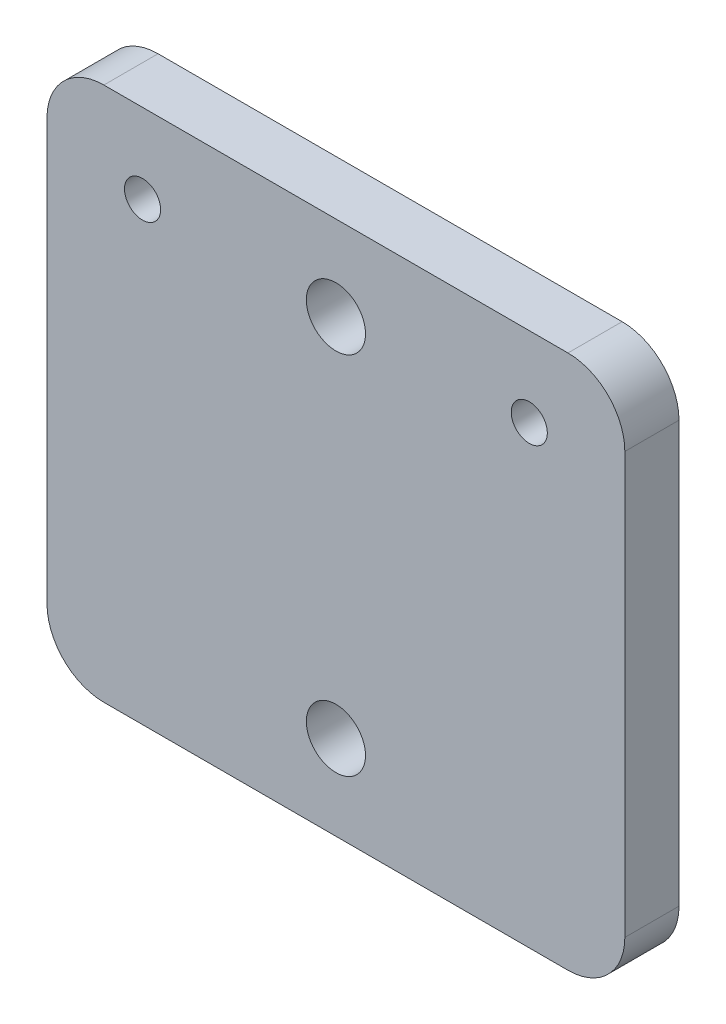
ISO-10303-21;
HEADER;
FILE_DESCRIPTION(('STEP AP214'),'2;1');
FILE_NAME('part.step','',(''),(''),'','','');
FILE_SCHEMA(('AUTOMOTIVE_DESIGN { 1 0 10303 214 1 1 1 1 }'));
ENDSEC;
DATA;
#1=APPLICATION_CONTEXT('core data for automotive mechanical design processes');
#2=APPLICATION_PROTOCOL_DEFINITION('international standard','automotive_design',2000,#1);
#3=PRODUCT_CONTEXT('',#1,'mechanical');
#4=PRODUCT('Part','Part','',(#3));
#5=PRODUCT_RELATED_PRODUCT_CATEGORY('part','',(#4));
#6=PRODUCT_DEFINITION_FORMATION('','',#4);
#7=PRODUCT_DEFINITION_CONTEXT('part definition',#1,'design');
#8=PRODUCT_DEFINITION('design','',#6,#7);
#9=PRODUCT_DEFINITION_SHAPE('','',#8);
#10=(LENGTH_UNIT() NAMED_UNIT(*) SI_UNIT(.MILLI.,.METRE.));
#11=(NAMED_UNIT(*) PLANE_ANGLE_UNIT() SI_UNIT($,.RADIAN.));
#12=(NAMED_UNIT(*) SI_UNIT($,.STERADIAN.) SOLID_ANGLE_UNIT());
#13=UNCERTAINTY_MEASURE_WITH_UNIT(LENGTH_MEASURE(1.E-05),#10,'distance_accuracy_value','');
#14=(GEOMETRIC_REPRESENTATION_CONTEXT(3) GLOBAL_UNCERTAINTY_ASSIGNED_CONTEXT((#13)) GLOBAL_UNIT_ASSIGNED_CONTEXT((#10,
#11,#12)) REPRESENTATION_CONTEXT('',''));
#15=CARTESIAN_POINT('',(0.,0.,0.));
#16=DIRECTION('',(0.,0.,1.));
#17=DIRECTION('',(1.,0.,0.));
#18=AXIS2_PLACEMENT_3D('',#15,#16,#17);
#19=CARTESIAN_POINT('',(0.,0.,4.7625));
#20=DIRECTION('',(1.,0.,0.));
#21=DIRECTION('',(0.,0.,-1.));
#22=AXIS2_PLACEMENT_3D('',#19,#20,#21);
#23=PLANE('',#22);
#24=DIRECTION('',(0.,-1.,0.));
#25=VECTOR('',#24,1.);
#26=CARTESIAN_POINT('',(0.,0.,0.));
#27=LINE('',#26,#25);
#28=CARTESIAN_POINT('',(0.,41.9999999999998,0.));
#29=VERTEX_POINT('',#28);
#30=CARTESIAN_POINT('',(0.,4.99999999999953,0.));
#31=VERTEX_POINT('',#30);
#32=EDGE_CURVE('E129',#29,#31,#27,.T.);
#33=ORIENTED_EDGE('',*,*,#32,.T.);
#34=DIRECTION('',(0.,0.,-1.));
#35=VECTOR('',#34,1.);
#36=CARTESIAN_POINT('',(0.,4.99999999999953,4.7625));
#37=LINE('',#36,#35);
#38=CARTESIAN_POINT('',(0.,4.99999999999953,4.7625));
#39=VERTEX_POINT('',#38);
#40=EDGE_CURVE('E107',#31,#39,#37,.F.);
#41=ORIENTED_EDGE('',*,*,#40,.T.);
#42=DIRECTION('',(0.,-1.,0.));
#43=VECTOR('',#42,1.);
#44=CARTESIAN_POINT('',(0.,0.,4.7625));
#45=LINE('',#44,#43);
#46=CARTESIAN_POINT('',(0.,41.9999999999998,4.7625));
#47=VERTEX_POINT('',#46);
#48=EDGE_CURVE('E139',#47,#39,#45,.T.);
#49=ORIENTED_EDGE('',*,*,#48,.F.);
#50=DIRECTION('',(0.,0.,-1.));
#51=VECTOR('',#50,1.);
#52=CARTESIAN_POINT('',(0.,41.9999999999998,4.7625));
#53=LINE('',#52,#51);
#54=EDGE_CURVE('E112',#47,#29,#53,.T.);
#55=ORIENTED_EDGE('',*,*,#54,.T.);
#56=EDGE_LOOP('',(#33,#41,#49,#55));
#57=FACE_BOUND('',#56,.T.);
#58=ADVANCED_FACE('F34',(#57),#23,.F.);
#59=CARTESIAN_POINT('',(0.,0.,4.7625));
#60=DIRECTION('',(0.,1.,0.));
#61=DIRECTION('',(0.,0.,1.));
#62=AXIS2_PLACEMENT_3D('',#59,#60,#61);
#63=PLANE('',#62);
#64=DIRECTION('',(1.,0.,0.));
#65=VECTOR('',#64,1.);
#66=CARTESIAN_POINT('',(0.,0.,4.7625));
#67=LINE('',#66,#65);
#68=CARTESIAN_POINT('',(5.00000000000007,-1.66533453693773E-13,4.7625));
#69=VERTEX_POINT('',#68);
#70=CARTESIAN_POINT('',(45.8,0.,4.7625));
#71=VERTEX_POINT('',#70);
#72=EDGE_CURVE('E122',#69,#71,#67,.T.);
#73=ORIENTED_EDGE('',*,*,#72,.F.);
#74=DIRECTION('',(0.,0.,-1.));
#75=VECTOR('',#74,1.);
#76=CARTESIAN_POINT('',(5.00000000000007,-1.66533453693773E-13,4.7625));
#77=LINE('',#76,#75);
#78=CARTESIAN_POINT('',(5.,-1.66533453693773E-13,0.));
#79=VERTEX_POINT('',#78);
#80=EDGE_CURVE('E106',#69,#79,#77,.T.);
#81=ORIENTED_EDGE('',*,*,#80,.T.);
#82=DIRECTION('',(1.,0.,0.));
#83=VECTOR('',#82,1.);
#84=CARTESIAN_POINT('',(0.,0.,0.));
#85=LINE('',#84,#83);
#86=CARTESIAN_POINT('',(45.8000000000002,0.,0.));
#87=VERTEX_POINT('',#86);
#88=EDGE_CURVE('E119',#79,#87,#85,.T.);
#89=ORIENTED_EDGE('',*,*,#88,.T.);
#90=DIRECTION('',(0.,0.,-1.));
#91=VECTOR('',#90,1.);
#92=CARTESIAN_POINT('',(45.8,0.,4.7625));
#93=LINE('',#92,#91);
#94=EDGE_CURVE('E124',#87,#71,#93,.F.);
#95=ORIENTED_EDGE('',*,*,#94,.T.);
#96=EDGE_LOOP('',(#73,#81,#89,#95));
#97=FACE_BOUND('',#96,.T.);
#98=ADVANCED_FACE('F118',(#97),#63,.F.);
#99=CARTESIAN_POINT('',(50.8000000000002,1.38777878078145E-13,4.7625));
#100=DIRECTION('',(-1.,0.,0.));
#101=DIRECTION('',(0.,0.,1.));
#102=AXIS2_PLACEMENT_3D('',#99,#100,#101);
#103=PLANE('',#102);
#104=DIRECTION('',(0.,1.,0.));
#105=VECTOR('',#104,1.);
#106=CARTESIAN_POINT('',(50.8000000000002,1.38777878078145E-13,4.7625));
#107=LINE('',#106,#105);
#108=CARTESIAN_POINT('',(50.8,4.99999999999984,4.7625));
#109=VERTEX_POINT('',#108);
#110=CARTESIAN_POINT('',(50.8,42.,4.7625));
#111=VERTEX_POINT('',#110);
#112=EDGE_CURVE('E189',#109,#111,#107,.T.);
#113=ORIENTED_EDGE('',*,*,#112,.F.);
#114=DIRECTION('',(0.,0.,-1.));
#115=VECTOR('',#114,1.);
#116=CARTESIAN_POINT('',(50.8,4.99999999999984,4.7625));
#117=LINE('',#116,#115);
#118=CARTESIAN_POINT('',(50.8000000000001,4.99999999999978,0.));
#119=VERTEX_POINT('',#118);
#120=EDGE_CURVE('E158',#109,#119,#117,.T.);
#121=ORIENTED_EDGE('',*,*,#120,.T.);
#122=DIRECTION('',(0.,1.,0.));
#123=VECTOR('',#122,1.);
#124=CARTESIAN_POINT('',(50.8,1.38777878078145E-13,0.));
#125=LINE('',#124,#123);
#126=CARTESIAN_POINT('',(50.8000000000001,42.0000000000001,0.));
#127=VERTEX_POINT('',#126);
#128=EDGE_CURVE('E128',#119,#127,#125,.T.);
#129=ORIENTED_EDGE('',*,*,#128,.T.);
#130=DIRECTION('',(0.,0.,-1.));
#131=VECTOR('',#130,1.);
#132=CARTESIAN_POINT('',(50.8,42.,4.7625));
#133=LINE('',#132,#131);
#134=EDGE_CURVE('E156',#127,#111,#133,.F.);
#135=ORIENTED_EDGE('',*,*,#134,.T.);
#136=EDGE_LOOP('',(#113,#121,#129,#135));
#137=FACE_BOUND('',#136,.T.);
#138=ADVANCED_FACE('F204',(#137),#103,.F.);
#139=CARTESIAN_POINT('',(0.,46.9999999999999,4.76250000000006));
#140=DIRECTION('',(0.,-1.,0.));
#141=DIRECTION('',(0.,0.,-1.));
#142=AXIS2_PLACEMENT_3D('',#139,#140,#141);
#143=PLANE('',#142);
#144=DIRECTION('',(-1.,0.,0.));
#145=VECTOR('',#144,1.);
#146=CARTESIAN_POINT('',(0.,46.9999999999999,4.76250000000006));
#147=LINE('',#146,#145);
#148=CARTESIAN_POINT('',(45.8000000000001,46.9999999999999,4.76250000000031));
#149=VERTEX_POINT('',#148);
#150=CARTESIAN_POINT('',(5.00000000000007,47.,4.76250000000031));
#151=VERTEX_POINT('',#150);
#152=EDGE_CURVE('E140',#149,#151,#147,.T.);
#153=ORIENTED_EDGE('',*,*,#152,.F.);
#154=DIRECTION('',(0.,0.,-1.));
#155=VECTOR('',#154,1.);
#156=CARTESIAN_POINT('',(45.8000000000001,46.9999999999999,4.76250000000031));
#157=LINE('',#156,#155);
#158=CARTESIAN_POINT('',(45.8,47.,3.05311331771918E-13));
#159=VERTEX_POINT('',#158);
#160=EDGE_CURVE('E11',#149,#159,#157,.T.);
#161=ORIENTED_EDGE('',*,*,#160,.T.);
#162=DIRECTION('',(-1.,0.,0.));
#163=VECTOR('',#162,1.);
#164=CARTESIAN_POINT('',(0.,47.,3.05311331771918E-13));
#165=LINE('',#164,#163);
#166=CARTESIAN_POINT('',(5.00000000000007,47.,3.05311331771918E-13));
#167=VERTEX_POINT('',#166);
#168=EDGE_CURVE('E132',#159,#167,#165,.T.);
#169=ORIENTED_EDGE('',*,*,#168,.T.);
#170=DIRECTION('',(0.,0.,-1.));
#171=VECTOR('',#170,1.);
#172=CARTESIAN_POINT('',(5.00000000000007,47.,4.76250000000031));
#173=LINE('',#172,#171);
#174=EDGE_CURVE('E43',#167,#151,#173,.F.);
#175=ORIENTED_EDGE('',*,*,#174,.T.);
#176=EDGE_LOOP('',(#153,#161,#169,#175));
#177=FACE_BOUND('',#176,.T.);
#178=ADVANCED_FACE('F198',(#177),#143,.F.);
#179=CARTESIAN_POINT('',(0.,0.,4.7625));
#180=DIRECTION('',(0.,0.,-1.));
#181=DIRECTION('',(-1.,0.,0.));
#182=AXIS2_PLACEMENT_3D('',#179,#180,#181);
#183=PLANE('',#182);
#184=CARTESIAN_POINT('',(8.4,39.9999999999998,4.7625));
#185=DIRECTION('',(0.,0.,1.));
#186=DIRECTION('',(1.,0.,0.));
#187=AXIS2_PLACEMENT_3D('',#184,#185,#186);
#188=CIRCLE('',#187,1.5875);
#189=CARTESIAN_POINT('',(9.9875,39.9999999999998,4.7625));
#190=VERTEX_POINT('',#189);
#191=EDGE_CURVE('E163',#190,#190,#188,.T.);
#192=ORIENTED_EDGE('',*,*,#191,.F.);
#193=EDGE_LOOP('',(#192));
#194=FACE_BOUND('',#193,.T.);
#195=CARTESIAN_POINT('',(42.4000000000002,39.9999999999998,4.7625));
#196=DIRECTION('',(0.,0.,1.));
#197=DIRECTION('',(1.,0.,0.));
#198=AXIS2_PLACEMENT_3D('',#195,#196,#197);
#199=CIRCLE('',#198,1.5875);
#200=CARTESIAN_POINT('',(43.9875000000002,39.9999999999998,4.7625));
#201=VERTEX_POINT('',#200);
#202=EDGE_CURVE('E169',#201,#201,#199,.T.);
#203=ORIENTED_EDGE('',*,*,#202,.F.);
#204=EDGE_LOOP('',(#203));
#205=FACE_BOUND('',#204,.T.);
#206=CARTESIAN_POINT('',(25.4000000000002,39.55,4.7625));
#207=DIRECTION('',(0.,0.,1.));
#208=DIRECTION('',(1.,0.,0.));
#209=AXIS2_PLACEMENT_3D('',#206,#207,#208);
#210=CIRCLE('',#209,2.6);
#211=CARTESIAN_POINT('',(28.0000000000001,39.55,4.7625));
#212=VERTEX_POINT('',#211);
#213=EDGE_CURVE('E178',#212,#212,#210,.T.);
#214=ORIENTED_EDGE('',*,*,#213,.F.);
#215=EDGE_LOOP('',(#214));
#216=FACE_BOUND('',#215,.T.);
#217=CARTESIAN_POINT('',(25.4000000000001,7.44999999999971,4.7625));
#218=DIRECTION('',(0.,0.,1.));
#219=DIRECTION('',(1.,0.,0.));
#220=AXIS2_PLACEMENT_3D('',#217,#218,#219);
#221=CIRCLE('',#220,2.6);
#222=CARTESIAN_POINT('',(28.0000000000001,7.44999999999971,4.7625));
#223=VERTEX_POINT('',#222);
#224=EDGE_CURVE('E167',#223,#223,#221,.T.);
#225=ORIENTED_EDGE('',*,*,#224,.F.);
#226=EDGE_LOOP('',(#225));
#227=FACE_BOUND('',#226,.T.);
#228=ORIENTED_EDGE('',*,*,#48,.T.);
#229=CARTESIAN_POINT('',(5.,4.99999999999984,4.76250000000028));
#230=DIRECTION('',(0.,0.,-1.));
#231=DIRECTION('',(-1.,0.,0.));
#232=AXIS2_PLACEMENT_3D('',#229,#230,#231);
#233=CIRCLE('',#232,5.);
#234=EDGE_CURVE('E154',#39,#69,#233,.F.);
#235=ORIENTED_EDGE('',*,*,#234,.T.);
#236=ORIENTED_EDGE('',*,*,#72,.T.);
#237=CARTESIAN_POINT('',(45.8000000000002,4.99999999999953,4.7625));
#238=DIRECTION('',(0.,0.,-1.));
#239=DIRECTION('',(-1.,0.,0.));
#240=AXIS2_PLACEMENT_3D('',#237,#238,#239);
#241=CIRCLE('',#240,5.);
#242=EDGE_CURVE('E152',#71,#109,#241,.F.);
#243=ORIENTED_EDGE('',*,*,#242,.T.);
#244=ORIENTED_EDGE('',*,*,#112,.T.);
#245=CARTESIAN_POINT('',(45.8000000000002,41.9999999999998,4.76250000000031));
#246=DIRECTION('',(0.,0.,-1.));
#247=DIRECTION('',(-1.,0.,0.));
#248=AXIS2_PLACEMENT_3D('',#245,#246,#247);
#249=CIRCLE('',#248,5.);
#250=EDGE_CURVE('E57',#111,#149,#249,.F.);
#251=ORIENTED_EDGE('',*,*,#250,.T.);
#252=ORIENTED_EDGE('',*,*,#152,.T.);
#253=CARTESIAN_POINT('',(4.99999999999996,42.,4.76250000000031));
#254=DIRECTION('',(0.,0.,-1.));
#255=DIRECTION('',(-1.,0.,0.));
#256=AXIS2_PLACEMENT_3D('',#253,#254,#255);
#257=CIRCLE('',#256,5.);
#258=EDGE_CURVE('E149',#151,#47,#257,.F.);
#259=ORIENTED_EDGE('',*,*,#258,.T.);
#260=EDGE_LOOP('',(#228,#235,#236,#243,#244,#251,#252,#259));
#261=FACE_BOUND('',#260,.T.);
#262=ADVANCED_FACE('F191',(#194,#205,#216,#227,#261),#183,.F.);
#263=CARTESIAN_POINT('',(0.,0.,0.));
#264=DIRECTION('',(0.,0.,-1.));
#265=DIRECTION('',(-1.,0.,0.));
#266=AXIS2_PLACEMENT_3D('',#263,#264,#265);
#267=PLANE('',#266);
#268=CARTESIAN_POINT('',(8.4,39.9999999999998,0.));
#269=DIRECTION('',(0.,0.,-1.));
#270=DIRECTION('',(-1.,0.,0.));
#271=AXIS2_PLACEMENT_3D('',#268,#269,#270);
#272=CIRCLE('',#271,1.5875);
#273=CARTESIAN_POINT('',(6.8125,39.9999999999998,0.));
#274=VERTEX_POINT('',#273);
#275=EDGE_CURVE('E38',#274,#274,#272,.T.);
#276=ORIENTED_EDGE('',*,*,#275,.F.);
#277=EDGE_LOOP('',(#276));
#278=FACE_BOUND('',#277,.T.);
#279=CARTESIAN_POINT('',(42.4000000000001,39.9999999999998,0.));
#280=DIRECTION('',(0.,0.,-1.));
#281=DIRECTION('',(-1.,0.,0.));
#282=AXIS2_PLACEMENT_3D('',#279,#280,#281);
#283=CIRCLE('',#282,1.5875);
#284=CARTESIAN_POINT('',(40.8125000000001,39.9999999999998,0.));
#285=VERTEX_POINT('',#284);
#286=EDGE_CURVE('E161',#285,#285,#283,.T.);
#287=ORIENTED_EDGE('',*,*,#286,.F.);
#288=EDGE_LOOP('',(#287));
#289=FACE_BOUND('',#288,.T.);
#290=CARTESIAN_POINT('',(25.4,39.55,0.));
#291=DIRECTION('',(0.,0.,1.));
#292=DIRECTION('',(1.,0.,0.));
#293=AXIS2_PLACEMENT_3D('',#290,#291,#292);
#294=CIRCLE('',#293,2.6);
#295=CARTESIAN_POINT('',(28.,39.55,0.));
#296=VERTEX_POINT('',#295);
#297=EDGE_CURVE('E134',#296,#296,#294,.T.);
#298=ORIENTED_EDGE('',*,*,#297,.T.);
#299=EDGE_LOOP('',(#298));
#300=FACE_BOUND('',#299,.T.);
#301=CARTESIAN_POINT('',(25.4,7.44999999999971,0.));
#302=DIRECTION('',(0.,0.,1.));
#303=DIRECTION('',(1.,0.,0.));
#304=AXIS2_PLACEMENT_3D('',#301,#302,#303);
#305=CIRCLE('',#304,2.6);
#306=CARTESIAN_POINT('',(28.,7.44999999999971,0.));
#307=VERTEX_POINT('',#306);
#308=EDGE_CURVE('E181',#307,#307,#305,.T.);
#309=ORIENTED_EDGE('',*,*,#308,.T.);
#310=EDGE_LOOP('',(#309));
#311=FACE_BOUND('',#310,.T.);
#312=ORIENTED_EDGE('',*,*,#88,.F.);
#313=CARTESIAN_POINT('',(5.00000000000007,4.99999999999984,3.05311331771918E-13));
#314=DIRECTION('',(0.,0.,-1.));
#315=DIRECTION('',(-1.,0.,0.));
#316=AXIS2_PLACEMENT_3D('',#313,#314,#315);
#317=CIRCLE('',#316,5.);
#318=EDGE_CURVE('E102',#79,#31,#317,.T.);
#319=ORIENTED_EDGE('',*,*,#318,.T.);
#320=ORIENTED_EDGE('',*,*,#32,.F.);
#321=CARTESIAN_POINT('',(5.,42.0000000000001,3.05311331771918E-13));
#322=DIRECTION('',(0.,0.,-1.));
#323=DIRECTION('',(-1.,0.,0.));
#324=AXIS2_PLACEMENT_3D('',#321,#322,#323);
#325=CIRCLE('',#324,5.);
#326=EDGE_CURVE('E123',#29,#167,#325,.T.);
#327=ORIENTED_EDGE('',*,*,#326,.T.);
#328=ORIENTED_EDGE('',*,*,#168,.F.);
#329=CARTESIAN_POINT('',(45.8,41.9999999999998,3.05311331771918E-13));
#330=DIRECTION('',(0.,0.,-1.));
#331=DIRECTION('',(-1.,0.,0.));
#332=AXIS2_PLACEMENT_3D('',#329,#330,#331);
#333=CIRCLE('',#332,5.);
#334=EDGE_CURVE('E143',#159,#127,#333,.T.);
#335=ORIENTED_EDGE('',*,*,#334,.T.);
#336=ORIENTED_EDGE('',*,*,#128,.F.);
#337=CARTESIAN_POINT('',(45.8000000000001,4.99999999999953,0.));
#338=DIRECTION('',(0.,0.,-1.));
#339=DIRECTION('',(-1.,0.,0.));
#340=AXIS2_PLACEMENT_3D('',#337,#338,#339);
#341=CIRCLE('',#340,5.);
#342=EDGE_CURVE('E113',#119,#87,#341,.T.);
#343=ORIENTED_EDGE('',*,*,#342,.T.);
#344=EDGE_LOOP('',(#312,#319,#320,#327,#328,#335,#336,#343));
#345=FACE_BOUND('',#344,.T.);
#346=ADVANCED_FACE('F126',(#278,#289,#300,#311,#345),#267,.T.);
#347=CARTESIAN_POINT('',(25.4,7.44999999999971,0.));
#348=DIRECTION('',(0.,0.,1.));
#349=DIRECTION('',(1.,0.,0.));
#350=AXIS2_PLACEMENT_3D('',#347,#348,#349);
#351=CYLINDRICAL_SURFACE('',#350,2.6);
#352=ORIENTED_EDGE('',*,*,#308,.F.);
#353=EDGE_LOOP('',(#352));
#354=FACE_BOUND('',#353,.T.);
#355=ORIENTED_EDGE('',*,*,#224,.T.);
#356=EDGE_LOOP('',(#355));
#357=FACE_BOUND('',#356,.T.);
#358=ADVANCED_FACE('F230',(#354,#357),#351,.F.);
#359=CARTESIAN_POINT('',(25.4,39.55,0.));
#360=DIRECTION('',(0.,0.,1.));
#361=DIRECTION('',(1.,0.,0.));
#362=AXIS2_PLACEMENT_3D('',#359,#360,#361);
#363=CYLINDRICAL_SURFACE('',#362,2.6);
#364=ORIENTED_EDGE('',*,*,#297,.F.);
#365=EDGE_LOOP('',(#364));
#366=FACE_BOUND('',#365,.T.);
#367=ORIENTED_EDGE('',*,*,#213,.T.);
#368=EDGE_LOOP('',(#367));
#369=FACE_BOUND('',#368,.T.);
#370=ADVANCED_FACE('F215',(#366,#369),#363,.F.);
#371=CARTESIAN_POINT('',(5.,4.99999999999984,4.76250000000028));
#372=DIRECTION('',(0.,0.,-1.));
#373=DIRECTION('',(-1.,0.,0.));
#374=AXIS2_PLACEMENT_3D('',#371,#372,#373);
#375=CYLINDRICAL_SURFACE('',#374,5.);
#376=ORIENTED_EDGE('',*,*,#234,.F.);
#377=ORIENTED_EDGE('',*,*,#40,.F.);
#378=ORIENTED_EDGE('',*,*,#318,.F.);
#379=ORIENTED_EDGE('',*,*,#80,.F.);
#380=EDGE_LOOP('',(#376,#377,#378,#379));
#381=FACE_BOUND('',#380,.T.);
#382=ADVANCED_FACE('F105',(#381),#375,.T.);
#383=CARTESIAN_POINT('',(45.8000000000002,4.99999999999953,4.7625));
#384=DIRECTION('',(0.,0.,-1.));
#385=DIRECTION('',(-1.,0.,0.));
#386=AXIS2_PLACEMENT_3D('',#383,#384,#385);
#387=CYLINDRICAL_SURFACE('',#386,5.);
#388=ORIENTED_EDGE('',*,*,#242,.F.);
#389=ORIENTED_EDGE('',*,*,#94,.F.);
#390=ORIENTED_EDGE('',*,*,#342,.F.);
#391=ORIENTED_EDGE('',*,*,#120,.F.);
#392=EDGE_LOOP('',(#388,#389,#390,#391));
#393=FACE_BOUND('',#392,.T.);
#394=ADVANCED_FACE('F208',(#393),#387,.T.);
#395=CARTESIAN_POINT('',(45.8000000000002,41.9999999999998,4.76250000000031));
#396=DIRECTION('',(0.,0.,-1.));
#397=DIRECTION('',(-1.,0.,0.));
#398=AXIS2_PLACEMENT_3D('',#395,#396,#397);
#399=CYLINDRICAL_SURFACE('',#398,5.);
#400=ORIENTED_EDGE('',*,*,#250,.F.);
#401=ORIENTED_EDGE('',*,*,#134,.F.);
#402=ORIENTED_EDGE('',*,*,#334,.F.);
#403=ORIENTED_EDGE('',*,*,#160,.F.);
#404=EDGE_LOOP('',(#400,#401,#402,#403));
#405=FACE_BOUND('',#404,.T.);
#406=ADVANCED_FACE('F200',(#405),#399,.T.);
#407=CARTESIAN_POINT('',(4.99999999999996,42.,4.76250000000031));
#408=DIRECTION('',(0.,0.,-1.));
#409=DIRECTION('',(-1.,0.,0.));
#410=AXIS2_PLACEMENT_3D('',#407,#408,#409);
#411=CYLINDRICAL_SURFACE('',#410,5.);
#412=ORIENTED_EDGE('',*,*,#258,.F.);
#413=ORIENTED_EDGE('',*,*,#174,.F.);
#414=ORIENTED_EDGE('',*,*,#326,.F.);
#415=ORIENTED_EDGE('',*,*,#54,.F.);
#416=EDGE_LOOP('',(#412,#413,#414,#415));
#417=FACE_BOUND('',#416,.T.);
#418=ADVANCED_FACE('F36',(#417),#411,.T.);
#419=CARTESIAN_POINT('',(42.4000000000001,39.9999999999995,-5.23749999999998));
#420=DIRECTION('',(0.,0.,1.));
#421=DIRECTION('',(1.,0.,0.));
#422=AXIS2_PLACEMENT_3D('',#419,#420,#421);
#423=CYLINDRICAL_SURFACE('',#422,1.5875);
#424=ORIENTED_EDGE('',*,*,#286,.T.);
#425=EDGE_LOOP('',(#424));
#426=FACE_BOUND('',#425,.T.);
#427=ORIENTED_EDGE('',*,*,#202,.T.);
#428=EDGE_LOOP('',(#427));
#429=FACE_BOUND('',#428,.T.);
#430=ADVANCED_FACE('F241',(#426,#429),#423,.F.);
#431=CARTESIAN_POINT('',(8.40000000000015,39.9999999999997,-5.23750000000001));
#432=DIRECTION('',(0.,0.,1.));
#433=DIRECTION('',(1.,0.,0.));
#434=AXIS2_PLACEMENT_3D('',#431,#432,#433);
#435=CYLINDRICAL_SURFACE('',#434,1.5875);
#436=ORIENTED_EDGE('',*,*,#275,.T.);
#437=EDGE_LOOP('',(#436));
#438=FACE_BOUND('',#437,.T.);
#439=ORIENTED_EDGE('',*,*,#191,.T.);
#440=EDGE_LOOP('',(#439));
#441=FACE_BOUND('',#440,.T.);
#442=ADVANCED_FACE('F244',(#438,#441),#435,.F.);
#443=CLOSED_SHELL('',(#58,#98,#138,#178,#262,#346,#358,#370,#382,#394,#406,#418,#430,#442));
#444=MANIFOLD_SOLID_BREP('B2',#443);
#445=ADVANCED_BREP_SHAPE_REPRESENTATION('',(#18,#444),#14);
#446=SHAPE_DEFINITION_REPRESENTATION(#9,#445);
ENDSEC;
END-ISO-10303-21;
